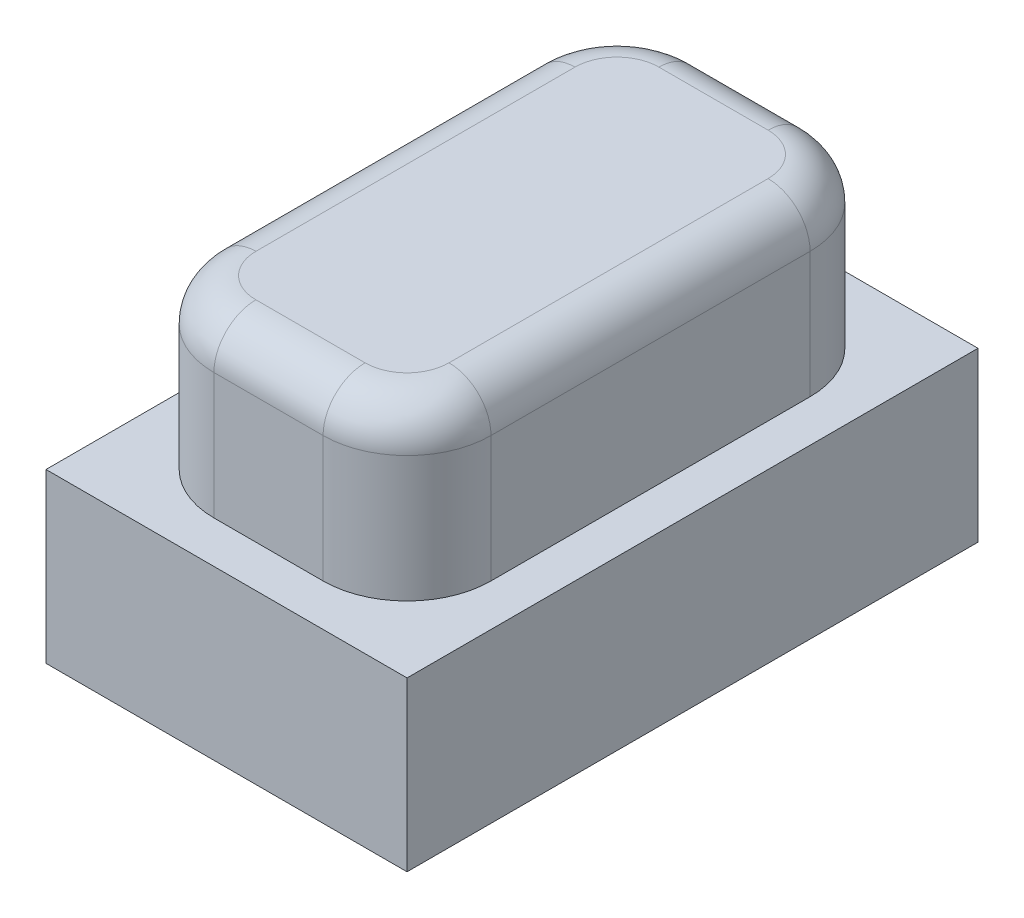
ISO-10303-21;
HEADER;
FILE_DESCRIPTION(('STEP AP214'),'2;1');
FILE_NAME('part.step','',(''),(''),'','','');
FILE_SCHEMA(('AUTOMOTIVE_DESIGN { 1 0 10303 214 1 1 1 1 }'));
ENDSEC;
DATA;
#1=APPLICATION_CONTEXT('core data for automotive mechanical design processes');
#2=APPLICATION_PROTOCOL_DEFINITION('international standard','automotive_design',2000,#1);
#3=PRODUCT_CONTEXT('',#1,'mechanical');
#4=PRODUCT('Part','Part','',(#3));
#5=PRODUCT_RELATED_PRODUCT_CATEGORY('part','',(#4));
#6=PRODUCT_DEFINITION_FORMATION('','',#4);
#7=PRODUCT_DEFINITION_CONTEXT('part definition',#1,'design');
#8=PRODUCT_DEFINITION('design','',#6,#7);
#9=PRODUCT_DEFINITION_SHAPE('','',#8);
#10=(LENGTH_UNIT() NAMED_UNIT(*) SI_UNIT(.MILLI.,.METRE.));
#11=(NAMED_UNIT(*) PLANE_ANGLE_UNIT() SI_UNIT($,.RADIAN.));
#12=(NAMED_UNIT(*) SI_UNIT($,.STERADIAN.) SOLID_ANGLE_UNIT());
#13=UNCERTAINTY_MEASURE_WITH_UNIT(LENGTH_MEASURE(1.E-05),#10,'distance_accuracy_value','');
#14=(GEOMETRIC_REPRESENTATION_CONTEXT(3) GLOBAL_UNCERTAINTY_ASSIGNED_CONTEXT((#13)) GLOBAL_UNIT_ASSIGNED_CONTEXT((#10,
#11,#12)) REPRESENTATION_CONTEXT('',''));
#15=CARTESIAN_POINT('',(0.,0.,0.));
#16=DIRECTION('',(0.,0.,1.));
#17=DIRECTION('',(1.,0.,0.));
#18=AXIS2_PLACEMENT_3D('',#15,#16,#17);
#19=CARTESIAN_POINT('',(0.65,2.,1.9));
#20=DIRECTION('',(0.,-1.,0.));
#21=DIRECTION('',(0.,0.,-1.));
#22=AXIS2_PLACEMENT_3D('',#19,#20,#21);
#23=CYLINDRICAL_SURFACE('',#22,1.);
#24=DIRECTION('',(0.,-1.,0.));
#25=VECTOR('',#24,1.);
#26=CARTESIAN_POINT('',(1.65,2.,1.89999999999999));
#27=LINE('',#26,#25);
#28=CARTESIAN_POINT('',(1.65,1.5,1.89999999999999));
#29=VERTEX_POINT('',#28);
#30=CARTESIAN_POINT('',(1.65,0.,1.89999999999999));
#31=VERTEX_POINT('',#30);
#32=EDGE_CURVE('E334',#29,#31,#27,.T.);
#33=ORIENTED_EDGE('',*,*,#32,.F.);
#34=CARTESIAN_POINT('',(0.65,1.5,1.9));
#35=DIRECTION('',(0.,1.,0.));
#36=DIRECTION('',(0.,0.,1.));
#37=AXIS2_PLACEMENT_3D('',#34,#35,#36);
#38=CIRCLE('',#37,1.);
#39=CARTESIAN_POINT('',(0.649999999999993,1.5,2.9));
#40=VERTEX_POINT('',#39);
#41=EDGE_CURVE('E53',#29,#40,#38,.F.);
#42=ORIENTED_EDGE('',*,*,#41,.T.);
#43=DIRECTION('',(0.,-1.,0.));
#44=VECTOR('',#43,1.);
#45=CARTESIAN_POINT('',(0.649999999999993,2.,2.9));
#46=LINE('',#45,#44);
#47=CARTESIAN_POINT('',(0.649999999999993,0.,2.9));
#48=VERTEX_POINT('',#47);
#49=EDGE_CURVE('E313',#40,#48,#46,.T.);
#50=ORIENTED_EDGE('',*,*,#49,.T.);
#51=CARTESIAN_POINT('',(0.65,0.,1.9));
#52=DIRECTION('',(0.,1.,0.));
#53=DIRECTION('',(0.,0.,1.));
#54=AXIS2_PLACEMENT_3D('',#51,#52,#53);
#55=CIRCLE('',#54,1.);
#56=EDGE_CURVE('E281',#48,#31,#55,.T.);
#57=ORIENTED_EDGE('',*,*,#56,.T.);
#58=EDGE_LOOP('',(#33,#42,#50,#57));
#59=FACE_BOUND('',#58,.T.);
#60=ADVANCED_FACE('F43',(#59),#23,.T.);
#61=CARTESIAN_POINT('',(1.65,2.,1.89999999999999));
#62=DIRECTION('',(-1.,0.,0.));
#63=DIRECTION('',(0.,0.,1.));
#64=AXIS2_PLACEMENT_3D('',#61,#62,#63);
#65=PLANE('',#64);
#66=DIRECTION('',(0.,-1.,0.));
#67=VECTOR('',#66,1.);
#68=CARTESIAN_POINT('',(1.65,2.,-1.89999999999999));
#69=LINE('',#68,#67);
#70=CARTESIAN_POINT('',(1.65,1.5,-1.89999999999999));
#71=VERTEX_POINT('',#70);
#72=CARTESIAN_POINT('',(1.65,0.,-1.89999999999999));
#73=VERTEX_POINT('',#72);
#74=EDGE_CURVE('E331',#71,#73,#69,.T.);
#75=ORIENTED_EDGE('',*,*,#74,.F.);
#76=DIRECTION('',(0.,0.,-1.));
#77=VECTOR('',#76,1.);
#78=CARTESIAN_POINT('',(1.65,1.5,1.89999999999999));
#79=LINE('',#78,#77);
#80=EDGE_CURVE('E68',#71,#29,#79,.F.);
#81=ORIENTED_EDGE('',*,*,#80,.T.);
#82=ORIENTED_EDGE('',*,*,#32,.T.);
#83=DIRECTION('',(0.,0.,-1.));
#84=VECTOR('',#83,1.);
#85=CARTESIAN_POINT('',(1.65,0.,1.89999999999999));
#86=LINE('',#85,#84);
#87=EDGE_CURVE('E285',#31,#73,#86,.T.);
#88=ORIENTED_EDGE('',*,*,#87,.T.);
#89=EDGE_LOOP('',(#75,#81,#82,#88));
#90=FACE_BOUND('',#89,.T.);
#91=ADVANCED_FACE('F424',(#90),#65,.F.);
#92=CARTESIAN_POINT('',(0.65,2.,-1.9));
#93=DIRECTION('',(0.,-1.,0.));
#94=DIRECTION('',(0.,0.,-1.));
#95=AXIS2_PLACEMENT_3D('',#92,#93,#94);
#96=CYLINDRICAL_SURFACE('',#95,1.);
#97=DIRECTION('',(0.,-1.,0.));
#98=VECTOR('',#97,1.);
#99=CARTESIAN_POINT('',(0.649999999999993,2.,-2.9));
#100=LINE('',#99,#98);
#101=CARTESIAN_POINT('',(0.649999999999993,1.5,-2.9));
#102=VERTEX_POINT('',#101);
#103=CARTESIAN_POINT('',(0.649999999999993,0.,-2.9));
#104=VERTEX_POINT('',#103);
#105=EDGE_CURVE('E328',#102,#104,#100,.T.);
#106=ORIENTED_EDGE('',*,*,#105,.F.);
#107=CARTESIAN_POINT('',(0.65,1.5,-1.9));
#108=DIRECTION('',(0.,1.,0.));
#109=DIRECTION('',(0.,0.,1.));
#110=AXIS2_PLACEMENT_3D('',#107,#108,#109);
#111=CIRCLE('',#110,1.);
#112=EDGE_CURVE('E375',#102,#71,#111,.F.);
#113=ORIENTED_EDGE('',*,*,#112,.T.);
#114=ORIENTED_EDGE('',*,*,#74,.T.);
#115=CARTESIAN_POINT('',(0.65,0.,-1.9));
#116=DIRECTION('',(0.,1.,0.));
#117=DIRECTION('',(0.,0.,-1.));
#118=AXIS2_PLACEMENT_3D('',#115,#116,#117);
#119=CIRCLE('',#118,1.);
#120=EDGE_CURVE('E289',#73,#104,#119,.T.);
#121=ORIENTED_EDGE('',*,*,#120,.T.);
#122=EDGE_LOOP('',(#106,#113,#114,#121));
#123=FACE_BOUND('',#122,.T.);
#124=ADVANCED_FACE('F422',(#123),#96,.T.);
#125=CARTESIAN_POINT('',(-0.649999999999993,2.,-2.9));
#126=DIRECTION('',(0.,0.,1.));
#127=DIRECTION('',(1.,0.,0.));
#128=AXIS2_PLACEMENT_3D('',#125,#126,#127);
#129=PLANE('',#128);
#130=DIRECTION('',(0.,-1.,0.));
#131=VECTOR('',#130,1.);
#132=CARTESIAN_POINT('',(-0.65,2.,-2.9));
#133=LINE('',#132,#131);
#134=CARTESIAN_POINT('',(-0.65,1.5,-2.9));
#135=VERTEX_POINT('',#134);
#136=CARTESIAN_POINT('',(-0.65,0.,-2.9));
#137=VERTEX_POINT('',#136);
#138=EDGE_CURVE('E325',#135,#137,#133,.T.);
#139=ORIENTED_EDGE('',*,*,#138,.F.);
#140=DIRECTION('',(-1.,0.,0.));
#141=VECTOR('',#140,1.);
#142=CARTESIAN_POINT('',(0.649999999999993,1.5,-2.9));
#143=LINE('',#142,#141);
#144=EDGE_CURVE('E372',#135,#102,#143,.F.);
#145=ORIENTED_EDGE('',*,*,#144,.T.);
#146=ORIENTED_EDGE('',*,*,#105,.T.);
#147=DIRECTION('',(-1.,0.,0.));
#148=VECTOR('',#147,1.);
#149=CARTESIAN_POINT('',(-0.649999999999993,0.,-2.9));
#150=LINE('',#149,#148);
#151=EDGE_CURVE('E293',#104,#137,#150,.T.);
#152=ORIENTED_EDGE('',*,*,#151,.T.);
#153=EDGE_LOOP('',(#139,#145,#146,#152));
#154=FACE_BOUND('',#153,.T.);
#155=ADVANCED_FACE('F464',(#154),#129,.F.);
#156=CARTESIAN_POINT('',(-0.65,2.,-1.9));
#157=DIRECTION('',(0.,-1.,0.));
#158=DIRECTION('',(0.,0.,-1.));
#159=AXIS2_PLACEMENT_3D('',#156,#157,#158);
#160=CYLINDRICAL_SURFACE('',#159,1.);
#161=DIRECTION('',(0.,-1.,0.));
#162=VECTOR('',#161,1.);
#163=CARTESIAN_POINT('',(-1.65,2.,-1.89999999999999));
#164=LINE('',#163,#162);
#165=CARTESIAN_POINT('',(-1.65,1.5,-1.89999999999999));
#166=VERTEX_POINT('',#165);
#167=CARTESIAN_POINT('',(-1.65,0.,-1.89999999999999));
#168=VERTEX_POINT('',#167);
#169=EDGE_CURVE('E322',#166,#168,#164,.T.);
#170=ORIENTED_EDGE('',*,*,#169,.F.);
#171=CARTESIAN_POINT('',(-0.65,1.5,-1.9));
#172=DIRECTION('',(0.,1.,0.));
#173=DIRECTION('',(0.,0.,1.));
#174=AXIS2_PLACEMENT_3D('',#171,#172,#173);
#175=CIRCLE('',#174,1.);
#176=EDGE_CURVE('E369',#166,#135,#175,.F.);
#177=ORIENTED_EDGE('',*,*,#176,.T.);
#178=ORIENTED_EDGE('',*,*,#138,.T.);
#179=CARTESIAN_POINT('',(-0.65,0.,-1.9));
#180=DIRECTION('',(0.,1.,0.));
#181=DIRECTION('',(0.,0.,-1.));
#182=AXIS2_PLACEMENT_3D('',#179,#180,#181);
#183=CIRCLE('',#182,1.);
#184=EDGE_CURVE('E297',#137,#168,#183,.T.);
#185=ORIENTED_EDGE('',*,*,#184,.T.);
#186=EDGE_LOOP('',(#170,#177,#178,#185));
#187=FACE_BOUND('',#186,.T.);
#188=ADVANCED_FACE('F460',(#187),#160,.T.);
#189=CARTESIAN_POINT('',(-1.65,2.,1.89999999999999));
#190=DIRECTION('',(1.,0.,0.));
#191=DIRECTION('',(0.,0.,-1.));
#192=AXIS2_PLACEMENT_3D('',#189,#190,#191);
#193=PLANE('',#192);
#194=DIRECTION('',(0.,-1.,0.));
#195=VECTOR('',#194,1.);
#196=CARTESIAN_POINT('',(-1.65,2.,1.89999999999999));
#197=LINE('',#196,#195);
#198=CARTESIAN_POINT('',(-1.65,1.5,1.89999999999999));
#199=VERTEX_POINT('',#198);
#200=CARTESIAN_POINT('',(-1.65,0.,1.89999999999999));
#201=VERTEX_POINT('',#200);
#202=EDGE_CURVE('E319',#199,#201,#197,.T.);
#203=ORIENTED_EDGE('',*,*,#202,.F.);
#204=DIRECTION('',(0.,0.,1.));
#205=VECTOR('',#204,1.);
#206=CARTESIAN_POINT('',(-1.65,1.5,-1.89999999999999));
#207=LINE('',#206,#205);
#208=EDGE_CURVE('E366',#199,#166,#207,.F.);
#209=ORIENTED_EDGE('',*,*,#208,.T.);
#210=ORIENTED_EDGE('',*,*,#169,.T.);
#211=DIRECTION('',(0.,0.,1.));
#212=VECTOR('',#211,1.);
#213=CARTESIAN_POINT('',(-1.65,0.,1.89999999999999));
#214=LINE('',#213,#212);
#215=EDGE_CURVE('E301',#168,#201,#214,.T.);
#216=ORIENTED_EDGE('',*,*,#215,.T.);
#217=EDGE_LOOP('',(#203,#209,#210,#216));
#218=FACE_BOUND('',#217,.T.);
#219=ADVANCED_FACE('F455',(#218),#193,.F.);
#220=CARTESIAN_POINT('',(-0.65,2.,1.9));
#221=DIRECTION('',(0.,-1.,0.));
#222=DIRECTION('',(0.,0.,-1.));
#223=AXIS2_PLACEMENT_3D('',#220,#221,#222);
#224=CYLINDRICAL_SURFACE('',#223,1.);
#225=DIRECTION('',(0.,-1.,0.));
#226=VECTOR('',#225,1.);
#227=CARTESIAN_POINT('',(-0.649999999999993,2.,2.9));
#228=LINE('',#227,#226);
#229=CARTESIAN_POINT('',(-0.649999999999993,1.5,2.9));
#230=VERTEX_POINT('',#229);
#231=CARTESIAN_POINT('',(-0.649999999999993,0.,2.9));
#232=VERTEX_POINT('',#231);
#233=EDGE_CURVE('E316',#230,#232,#228,.T.);
#234=ORIENTED_EDGE('',*,*,#233,.F.);
#235=CARTESIAN_POINT('',(-0.65,1.5,1.9));
#236=DIRECTION('',(0.,1.,0.));
#237=DIRECTION('',(0.,0.,1.));
#238=AXIS2_PLACEMENT_3D('',#235,#236,#237);
#239=CIRCLE('',#238,1.);
#240=EDGE_CURVE('E362',#230,#199,#239,.F.);
#241=ORIENTED_EDGE('',*,*,#240,.T.);
#242=ORIENTED_EDGE('',*,*,#202,.T.);
#243=CARTESIAN_POINT('',(-0.65,0.,1.9));
#244=DIRECTION('',(0.,1.,0.));
#245=DIRECTION('',(0.,0.,-1.));
#246=AXIS2_PLACEMENT_3D('',#243,#244,#245);
#247=CIRCLE('',#246,1.);
#248=EDGE_CURVE('E305',#201,#232,#247,.T.);
#249=ORIENTED_EDGE('',*,*,#248,.T.);
#250=EDGE_LOOP('',(#234,#241,#242,#249));
#251=FACE_BOUND('',#250,.T.);
#252=ADVANCED_FACE('F452',(#251),#224,.T.);
#253=CARTESIAN_POINT('',(-0.649999999999993,2.,2.9));
#254=DIRECTION('',(0.,0.,-1.));
#255=DIRECTION('',(-1.,0.,0.));
#256=AXIS2_PLACEMENT_3D('',#253,#254,#255);
#257=PLANE('',#256);
#258=ORIENTED_EDGE('',*,*,#49,.F.);
#259=DIRECTION('',(1.,0.,0.));
#260=VECTOR('',#259,1.);
#261=CARTESIAN_POINT('',(-0.649999999999993,1.5,2.9));
#262=LINE('',#261,#260);
#263=EDGE_CURVE('E11',#40,#230,#262,.F.);
#264=ORIENTED_EDGE('',*,*,#263,.T.);
#265=ORIENTED_EDGE('',*,*,#233,.T.);
#266=DIRECTION('',(1.,0.,0.));
#267=VECTOR('',#266,1.);
#268=CARTESIAN_POINT('',(-0.649999999999993,0.,2.9));
#269=LINE('',#268,#267);
#270=EDGE_CURVE('E309',#232,#48,#269,.T.);
#271=ORIENTED_EDGE('',*,*,#270,.T.);
#272=EDGE_LOOP('',(#258,#264,#265,#271));
#273=FACE_BOUND('',#272,.T.);
#274=ADVANCED_FACE('F434',(#273),#257,.F.);
#275=CARTESIAN_POINT('',(0.65,2.,1.9));
#276=DIRECTION('',(0.,1.,0.));
#277=DIRECTION('',(0.,0.,1.));
#278=AXIS2_PLACEMENT_3D('',#275,#276,#277);
#279=PLANE('',#278);
#280=DIRECTION('',(0.,0.,1.));
#281=VECTOR('',#280,1.);
#282=CARTESIAN_POINT('',(-1.15,2.,1.89999999999999));
#283=LINE('',#282,#281);
#284=CARTESIAN_POINT('',(-1.15,2.,-1.89999999999999));
#285=VERTEX_POINT('',#284);
#286=CARTESIAN_POINT('',(-1.15,2.,1.9));
#287=VERTEX_POINT('',#286);
#288=EDGE_CURVE('E355',#285,#287,#283,.T.);
#289=ORIENTED_EDGE('',*,*,#288,.T.);
#290=CARTESIAN_POINT('',(-0.65,2.,1.9));
#291=DIRECTION('',(0.,1.,0.));
#292=DIRECTION('',(0.,0.,1.));
#293=AXIS2_PLACEMENT_3D('',#290,#291,#292);
#294=CIRCLE('',#293,0.5);
#295=CARTESIAN_POINT('',(-0.649999999999996,2.,2.4));
#296=VERTEX_POINT('',#295);
#297=EDGE_CURVE('E358',#287,#296,#294,.T.);
#298=ORIENTED_EDGE('',*,*,#297,.T.);
#299=DIRECTION('',(1.,0.,0.));
#300=VECTOR('',#299,1.);
#301=CARTESIAN_POINT('',(0.649999999999993,2.,2.4));
#302=LINE('',#301,#300);
#303=CARTESIAN_POINT('',(0.649999999999997,2.,2.4));
#304=VERTEX_POINT('',#303);
#305=EDGE_CURVE('E337',#296,#304,#302,.T.);
#306=ORIENTED_EDGE('',*,*,#305,.T.);
#307=CARTESIAN_POINT('',(0.65,2.,1.9));
#308=DIRECTION('',(0.,1.,0.));
#309=DIRECTION('',(0.,0.,1.));
#310=AXIS2_PLACEMENT_3D('',#307,#308,#309);
#311=CIRCLE('',#310,0.5);
#312=CARTESIAN_POINT('',(1.15,2.,1.89999999999999));
#313=VERTEX_POINT('',#312);
#314=EDGE_CURVE('E340',#304,#313,#311,.T.);
#315=ORIENTED_EDGE('',*,*,#314,.T.);
#316=DIRECTION('',(0.,0.,-1.));
#317=VECTOR('',#316,1.);
#318=CARTESIAN_POINT('',(1.15,2.,-1.89999999999999));
#319=LINE('',#318,#317);
#320=CARTESIAN_POINT('',(1.15,2.,-1.9));
#321=VERTEX_POINT('',#320);
#322=EDGE_CURVE('E343',#313,#321,#319,.T.);
#323=ORIENTED_EDGE('',*,*,#322,.T.);
#324=CARTESIAN_POINT('',(0.65,2.,-1.9));
#325=DIRECTION('',(0.,1.,0.));
#326=DIRECTION('',(0.,0.,1.));
#327=AXIS2_PLACEMENT_3D('',#324,#325,#326);
#328=CIRCLE('',#327,0.5);
#329=CARTESIAN_POINT('',(0.649999999999993,2.,-2.4));
#330=VERTEX_POINT('',#329);
#331=EDGE_CURVE('E346',#321,#330,#328,.T.);
#332=ORIENTED_EDGE('',*,*,#331,.T.);
#333=DIRECTION('',(-1.,0.,0.));
#334=VECTOR('',#333,1.);
#335=CARTESIAN_POINT('',(-0.65,2.,-2.4));
#336=LINE('',#335,#334);
#337=CARTESIAN_POINT('',(-0.65,2.,-2.4));
#338=VERTEX_POINT('',#337);
#339=EDGE_CURVE('E349',#330,#338,#336,.T.);
#340=ORIENTED_EDGE('',*,*,#339,.T.);
#341=CARTESIAN_POINT('',(-0.65,2.,-1.9));
#342=DIRECTION('',(0.,1.,0.));
#343=DIRECTION('',(0.,0.,1.));
#344=AXIS2_PLACEMENT_3D('',#341,#342,#343);
#345=CIRCLE('',#344,0.5);
#346=EDGE_CURVE('E352',#338,#285,#345,.T.);
#347=ORIENTED_EDGE('',*,*,#346,.T.);
#348=EDGE_LOOP('',(#289,#298,#306,#315,#323,#332,#340,#347));
#349=FACE_BOUND('',#348,.T.);
#350=ADVANCED_FACE('F519',(#349),#279,.T.);
#351=CARTESIAN_POINT('',(0.,0.,0.));
#352=DIRECTION('',(0.,1.,0.));
#353=DIRECTION('',(0.,0.,1.));
#354=AXIS2_PLACEMENT_3D('',#351,#352,#353);
#355=PLANE('',#354);
#356=DIRECTION('',(0.,0.,-1.));
#357=VECTOR('',#356,1.);
#358=CARTESIAN_POINT('',(-2.15,0.,3.4));
#359=LINE('',#358,#357);
#360=CARTESIAN_POINT('',(-2.15,0.,3.4));
#361=VERTEX_POINT('',#360);
#362=CARTESIAN_POINT('',(-2.15,0.,-3.4));
#363=VERTEX_POINT('',#362);
#364=EDGE_CURVE('E252',#361,#363,#359,.T.);
#365=ORIENTED_EDGE('',*,*,#364,.F.);
#366=DIRECTION('',(-1.,0.,0.));
#367=VECTOR('',#366,1.);
#368=CARTESIAN_POINT('',(2.15,0.,3.4));
#369=LINE('',#368,#367);
#370=CARTESIAN_POINT('',(2.15,0.,3.4));
#371=VERTEX_POINT('',#370);
#372=EDGE_CURVE('E262',#371,#361,#369,.T.);
#373=ORIENTED_EDGE('',*,*,#372,.F.);
#374=DIRECTION('',(0.,0.,1.));
#375=VECTOR('',#374,1.);
#376=CARTESIAN_POINT('',(2.15,0.,3.4));
#377=LINE('',#376,#375);
#378=CARTESIAN_POINT('',(2.15,0.,-3.4));
#379=VERTEX_POINT('',#378);
#380=EDGE_CURVE('E259',#379,#371,#377,.T.);
#381=ORIENTED_EDGE('',*,*,#380,.F.);
#382=DIRECTION('',(1.,0.,0.));
#383=VECTOR('',#382,1.);
#384=CARTESIAN_POINT('',(2.15,0.,-3.4));
#385=LINE('',#384,#383);
#386=EDGE_CURVE('E256',#363,#379,#385,.T.);
#387=ORIENTED_EDGE('',*,*,#386,.F.);
#388=EDGE_LOOP('',(#365,#373,#381,#387));
#389=FACE_BOUND('',#388,.T.);
#390=ORIENTED_EDGE('',*,*,#56,.F.);
#391=ORIENTED_EDGE('',*,*,#270,.F.);
#392=ORIENTED_EDGE('',*,*,#248,.F.);
#393=ORIENTED_EDGE('',*,*,#215,.F.);
#394=ORIENTED_EDGE('',*,*,#184,.F.);
#395=ORIENTED_EDGE('',*,*,#151,.F.);
#396=ORIENTED_EDGE('',*,*,#120,.F.);
#397=ORIENTED_EDGE('',*,*,#87,.F.);
#398=EDGE_LOOP('',(#390,#391,#392,#393,#394,#395,#396,#397));
#399=FACE_BOUND('',#398,.T.);
#400=ADVANCED_FACE('F428',(#389,#399),#355,.T.);
#401=CARTESIAN_POINT('',(-2.15,-1.,3.4));
#402=DIRECTION('',(1.,0.,0.));
#403=DIRECTION('',(0.,0.,-1.));
#404=AXIS2_PLACEMENT_3D('',#401,#402,#403);
#405=PLANE('',#404);
#406=ORIENTED_EDGE('',*,*,#364,.T.);
#407=DIRECTION('',(0.,1.,0.));
#408=VECTOR('',#407,1.);
#409=CARTESIAN_POINT('',(-2.15,-1.,-3.4));
#410=LINE('',#409,#408);
#411=CARTESIAN_POINT('',(-2.15,-2.,-3.4));
#412=VERTEX_POINT('',#411);
#413=EDGE_CURVE('E277',#412,#363,#410,.T.);
#414=ORIENTED_EDGE('',*,*,#413,.F.);
#415=DIRECTION('',(0.,0.,-1.));
#416=VECTOR('',#415,1.);
#417=CARTESIAN_POINT('',(-2.15,-2.,-3.4));
#418=LINE('',#417,#416);
#419=CARTESIAN_POINT('',(-2.15,-2.,3.4));
#420=VERTEX_POINT('',#419);
#421=EDGE_CURVE('E244',#420,#412,#418,.T.);
#422=ORIENTED_EDGE('',*,*,#421,.F.);
#423=DIRECTION('',(0.,1.,0.));
#424=VECTOR('',#423,1.);
#425=CARTESIAN_POINT('',(-2.15,-1.,3.4));
#426=LINE('',#425,#424);
#427=EDGE_CURVE('E265',#420,#361,#426,.T.);
#428=ORIENTED_EDGE('',*,*,#427,.T.);
#429=EDGE_LOOP('',(#406,#414,#422,#428));
#430=FACE_BOUND('',#429,.T.);
#431=ADVANCED_FACE('F518',(#430),#405,.F.);
#432=CARTESIAN_POINT('',(2.15,-1.,-3.4));
#433=DIRECTION('',(0.,0.,1.));
#434=DIRECTION('',(1.,0.,0.));
#435=AXIS2_PLACEMENT_3D('',#432,#433,#434);
#436=PLANE('',#435);
#437=ORIENTED_EDGE('',*,*,#386,.T.);
#438=DIRECTION('',(0.,1.,0.));
#439=VECTOR('',#438,1.);
#440=CARTESIAN_POINT('',(2.15,-1.,-3.4));
#441=LINE('',#440,#439);
#442=CARTESIAN_POINT('',(2.15,-2.,-3.4));
#443=VERTEX_POINT('',#442);
#444=EDGE_CURVE('E273',#443,#379,#441,.T.);
#445=ORIENTED_EDGE('',*,*,#444,.F.);
#446=DIRECTION('',(1.,0.,0.));
#447=VECTOR('',#446,1.);
#448=CARTESIAN_POINT('',(2.15,-2.,-3.4));
#449=LINE('',#448,#447);
#450=EDGE_CURVE('E248',#412,#443,#449,.T.);
#451=ORIENTED_EDGE('',*,*,#450,.F.);
#452=ORIENTED_EDGE('',*,*,#413,.T.);
#453=EDGE_LOOP('',(#437,#445,#451,#452));
#454=FACE_BOUND('',#453,.T.);
#455=ADVANCED_FACE('F528',(#454),#436,.F.);
#456=CARTESIAN_POINT('',(2.15,-1.,3.4));
#457=DIRECTION('',(-1.,0.,0.));
#458=DIRECTION('',(0.,0.,1.));
#459=AXIS2_PLACEMENT_3D('',#456,#457,#458);
#460=PLANE('',#459);
#461=ORIENTED_EDGE('',*,*,#380,.T.);
#462=DIRECTION('',(0.,1.,0.));
#463=VECTOR('',#462,1.);
#464=CARTESIAN_POINT('',(2.15,-1.,3.4));
#465=LINE('',#464,#463);
#466=CARTESIAN_POINT('',(2.15,-2.,3.4));
#467=VERTEX_POINT('',#466);
#468=EDGE_CURVE('E269',#467,#371,#465,.T.);
#469=ORIENTED_EDGE('',*,*,#468,.F.);
#470=DIRECTION('',(0.,0.,1.));
#471=VECTOR('',#470,1.);
#472=CARTESIAN_POINT('',(2.15,-2.,-3.4));
#473=LINE('',#472,#471);
#474=EDGE_CURVE('E203',#443,#467,#473,.T.);
#475=ORIENTED_EDGE('',*,*,#474,.F.);
#476=ORIENTED_EDGE('',*,*,#444,.T.);
#477=EDGE_LOOP('',(#461,#469,#475,#476));
#478=FACE_BOUND('',#477,.T.);
#479=ADVANCED_FACE('F524',(#478),#460,.F.);
#480=CARTESIAN_POINT('',(2.15,-1.,3.4));
#481=DIRECTION('',(0.,0.,-1.));
#482=DIRECTION('',(-1.,0.,0.));
#483=AXIS2_PLACEMENT_3D('',#480,#481,#482);
#484=PLANE('',#483);
#485=ORIENTED_EDGE('',*,*,#372,.T.);
#486=ORIENTED_EDGE('',*,*,#427,.F.);
#487=DIRECTION('',(-1.,0.,0.));
#488=VECTOR('',#487,1.);
#489=CARTESIAN_POINT('',(2.15,-2.,3.4));
#490=LINE('',#489,#488);
#491=EDGE_CURVE('E240',#467,#420,#490,.T.);
#492=ORIENTED_EDGE('',*,*,#491,.F.);
#493=ORIENTED_EDGE('',*,*,#468,.T.);
#494=EDGE_LOOP('',(#485,#486,#492,#493));
#495=FACE_BOUND('',#494,.T.);
#496=ADVANCED_FACE('F521',(#495),#484,.F.);
#497=CARTESIAN_POINT('',(0.,-2.,0.));
#498=DIRECTION('',(0.,-1.,0.));
#499=DIRECTION('',(0.,0.,-1.));
#500=AXIS2_PLACEMENT_3D('',#497,#498,#499);
#501=PLANE('',#500);
#502=ORIENTED_EDGE('',*,*,#474,.T.);
#503=ORIENTED_EDGE('',*,*,#491,.T.);
#504=ORIENTED_EDGE('',*,*,#421,.T.);
#505=ORIENTED_EDGE('',*,*,#450,.T.);
#506=EDGE_LOOP('',(#502,#503,#504,#505));
#507=FACE_BOUND('',#506,.T.);
#508=DIRECTION('',(-1.,0.,0.));
#509=VECTOR('',#508,1.);
#510=CARTESIAN_POINT('',(1.65,-2.,2.9));
#511=LINE('',#510,#509);
#512=CARTESIAN_POINT('',(1.65,-2.,2.9));
#513=VERTEX_POINT('',#512);
#514=CARTESIAN_POINT('',(-1.65,-2.,2.9));
#515=VERTEX_POINT('',#514);
#516=EDGE_CURVE('E194',#513,#515,#511,.T.);
#517=ORIENTED_EDGE('',*,*,#516,.F.);
#518=DIRECTION('',(0.,0.,1.));
#519=VECTOR('',#518,1.);
#520=CARTESIAN_POINT('',(1.65,-2.,-2.9));
#521=LINE('',#520,#519);
#522=CARTESIAN_POINT('',(1.65,-2.,-2.9));
#523=VERTEX_POINT('',#522);
#524=EDGE_CURVE('E183',#523,#513,#521,.T.);
#525=ORIENTED_EDGE('',*,*,#524,.F.);
#526=DIRECTION('',(1.,0.,0.));
#527=VECTOR('',#526,1.);
#528=CARTESIAN_POINT('',(1.65,-2.,-2.9));
#529=LINE('',#528,#527);
#530=CARTESIAN_POINT('',(-1.65,-2.,-2.9));
#531=VERTEX_POINT('',#530);
#532=EDGE_CURVE('E213',#531,#523,#529,.T.);
#533=ORIENTED_EDGE('',*,*,#532,.F.);
#534=DIRECTION('',(0.,0.,-1.));
#535=VECTOR('',#534,1.);
#536=CARTESIAN_POINT('',(-1.65,-2.,-2.9));
#537=LINE('',#536,#535);
#538=EDGE_CURVE('E209',#515,#531,#537,.T.);
#539=ORIENTED_EDGE('',*,*,#538,.F.);
#540=EDGE_LOOP('',(#517,#525,#533,#539));
#541=FACE_BOUND('',#540,.T.);
#542=ADVANCED_FACE('F207',(#507,#541),#501,.T.);
#543=CARTESIAN_POINT('',(1.65,-2.,-2.9));
#544=DIRECTION('',(-1.,0.,0.));
#545=DIRECTION('',(0.,0.,1.));
#546=AXIS2_PLACEMENT_3D('',#543,#544,#545);
#547=PLANE('',#546);
#548=DIRECTION('',(0.,0.,1.));
#549=VECTOR('',#548,1.);
#550=CARTESIAN_POINT('',(1.65,-1.,-2.9));
#551=LINE('',#550,#549);
#552=CARTESIAN_POINT('',(1.65,-1.,-2.9));
#553=VERTEX_POINT('',#552);
#554=CARTESIAN_POINT('',(1.65,-1.,2.9));
#555=VERTEX_POINT('',#554);
#556=EDGE_CURVE('E218',#553,#555,#551,.T.);
#557=ORIENTED_EDGE('',*,*,#556,.F.);
#558=DIRECTION('',(0.,1.,0.));
#559=VECTOR('',#558,1.);
#560=CARTESIAN_POINT('',(1.65,-2.,-2.9));
#561=LINE('',#560,#559);
#562=EDGE_CURVE('E189',#523,#553,#561,.T.);
#563=ORIENTED_EDGE('',*,*,#562,.F.);
#564=ORIENTED_EDGE('',*,*,#524,.T.);
#565=DIRECTION('',(0.,1.,0.));
#566=VECTOR('',#565,1.);
#567=CARTESIAN_POINT('',(1.65,-2.,2.9));
#568=LINE('',#567,#566);
#569=EDGE_CURVE('E187',#513,#555,#568,.T.);
#570=ORIENTED_EDGE('',*,*,#569,.T.);
#571=EDGE_LOOP('',(#557,#563,#564,#570));
#572=FACE_BOUND('',#571,.T.);
#573=ADVANCED_FACE('F186',(#572),#547,.T.);
#574=CARTESIAN_POINT('',(1.65,-2.,2.9));
#575=DIRECTION('',(0.,0.,-1.));
#576=DIRECTION('',(-1.,0.,0.));
#577=AXIS2_PLACEMENT_3D('',#574,#575,#576);
#578=PLANE('',#577);
#579=DIRECTION('',(-1.,0.,0.));
#580=VECTOR('',#579,1.);
#581=CARTESIAN_POINT('',(1.65,-1.,2.9));
#582=LINE('',#581,#580);
#583=CARTESIAN_POINT('',(-1.65,-1.,2.9));
#584=VERTEX_POINT('',#583);
#585=EDGE_CURVE('E201',#555,#584,#582,.T.);
#586=ORIENTED_EDGE('',*,*,#585,.F.);
#587=ORIENTED_EDGE('',*,*,#569,.F.);
#588=ORIENTED_EDGE('',*,*,#516,.T.);
#589=DIRECTION('',(0.,1.,0.));
#590=VECTOR('',#589,1.);
#591=CARTESIAN_POINT('',(-1.65,-2.,2.9));
#592=LINE('',#591,#590);
#593=EDGE_CURVE('E204',#515,#584,#592,.T.);
#594=ORIENTED_EDGE('',*,*,#593,.T.);
#595=EDGE_LOOP('',(#586,#587,#588,#594));
#596=FACE_BOUND('',#595,.T.);
#597=ADVANCED_FACE('F198',(#596),#578,.T.);
#598=CARTESIAN_POINT('',(-1.65,-2.,-2.9));
#599=DIRECTION('',(1.,0.,0.));
#600=DIRECTION('',(0.,0.,-1.));
#601=AXIS2_PLACEMENT_3D('',#598,#599,#600);
#602=PLANE('',#601);
#603=DIRECTION('',(0.,0.,-1.));
#604=VECTOR('',#603,1.);
#605=CARTESIAN_POINT('',(-1.65,-1.,-2.9));
#606=LINE('',#605,#604);
#607=CARTESIAN_POINT('',(-1.65,-1.,-2.9));
#608=VERTEX_POINT('',#607);
#609=EDGE_CURVE('E223',#584,#608,#606,.T.);
#610=ORIENTED_EDGE('',*,*,#609,.F.);
#611=ORIENTED_EDGE('',*,*,#593,.F.);
#612=ORIENTED_EDGE('',*,*,#538,.T.);
#613=DIRECTION('',(0.,1.,0.));
#614=VECTOR('',#613,1.);
#615=CARTESIAN_POINT('',(-1.65,-2.,-2.9));
#616=LINE('',#615,#614);
#617=EDGE_CURVE('E232',#531,#608,#616,.T.);
#618=ORIENTED_EDGE('',*,*,#617,.T.);
#619=EDGE_LOOP('',(#610,#611,#612,#618));
#620=FACE_BOUND('',#619,.T.);
#621=ADVANCED_FACE('F510',(#620),#602,.T.);
#622=CARTESIAN_POINT('',(1.65,-2.,-2.9));
#623=DIRECTION('',(0.,0.,1.));
#624=DIRECTION('',(1.,0.,0.));
#625=AXIS2_PLACEMENT_3D('',#622,#623,#624);
#626=PLANE('',#625);
#627=DIRECTION('',(1.,0.,0.));
#628=VECTOR('',#627,1.);
#629=CARTESIAN_POINT('',(1.65,-1.,-2.9));
#630=LINE('',#629,#628);
#631=EDGE_CURVE('E195',#608,#553,#630,.T.);
#632=ORIENTED_EDGE('',*,*,#631,.F.);
#633=ORIENTED_EDGE('',*,*,#617,.F.);
#634=ORIENTED_EDGE('',*,*,#532,.T.);
#635=ORIENTED_EDGE('',*,*,#562,.T.);
#636=EDGE_LOOP('',(#632,#633,#634,#635));
#637=FACE_BOUND('',#636,.T.);
#638=ADVANCED_FACE('F504',(#637),#626,.T.);
#639=CARTESIAN_POINT('',(0.,-1.,0.));
#640=DIRECTION('',(0.,1.,0.));
#641=DIRECTION('',(0.,0.,1.));
#642=AXIS2_PLACEMENT_3D('',#639,#640,#641);
#643=PLANE('',#642);
#644=ORIENTED_EDGE('',*,*,#631,.T.);
#645=ORIENTED_EDGE('',*,*,#556,.T.);
#646=ORIENTED_EDGE('',*,*,#585,.T.);
#647=ORIENTED_EDGE('',*,*,#609,.T.);
#648=EDGE_LOOP('',(#644,#645,#646,#647));
#649=FACE_BOUND('',#648,.T.);
#650=ADVANCED_FACE('F500',(#649),#643,.F.);
#651=CARTESIAN_POINT('',(0.65,1.5,-1.9));
#652=DIRECTION('',(0.,1.,0.));
#653=DIRECTION('',(0.,0.,1.));
#654=AXIS2_PLACEMENT_3D('',#651,#652,#653);
#655=DEGENERATE_TOROIDAL_SURFACE('',#654,0.5,0.5,.T.);
#656=CARTESIAN_POINT('',(1.15,1.5,-1.9));
#657=DIRECTION('',(0.,0.,1.));
#658=DIRECTION('',(1.,0.,0.));
#659=AXIS2_PLACEMENT_3D('',#656,#657,#658);
#660=CIRCLE('',#659,0.5);
#661=EDGE_CURVE('E403',#71,#321,#660,.T.);
#662=ORIENTED_EDGE('',*,*,#661,.F.);
#663=ORIENTED_EDGE('',*,*,#112,.F.);
#664=CARTESIAN_POINT('',(0.649999999999993,1.5,-2.4));
#665=DIRECTION('',(-1.,0.,0.));
#666=DIRECTION('',(0.,0.,1.));
#667=AXIS2_PLACEMENT_3D('',#664,#665,#666);
#668=CIRCLE('',#667,0.5);
#669=EDGE_CURVE('E47',#330,#102,#668,.T.);
#670=ORIENTED_EDGE('',*,*,#669,.F.);
#671=ORIENTED_EDGE('',*,*,#331,.F.);
#672=EDGE_LOOP('',(#662,#663,#670,#671));
#673=FACE_BOUND('',#672,.T.);
#674=ADVANCED_FACE('F45',(#673),#655,.T.);
#675=CARTESIAN_POINT('',(0.65,1.5,-2.4));
#676=DIRECTION('',(1.,0.,0.));
#677=DIRECTION('',(0.,0.,-1.));
#678=AXIS2_PLACEMENT_3D('',#675,#676,#677);
#679=CYLINDRICAL_SURFACE('',#678,0.5);
#680=ORIENTED_EDGE('',*,*,#669,.T.);
#681=ORIENTED_EDGE('',*,*,#144,.F.);
#682=CARTESIAN_POINT('',(-0.65,1.5,-2.4));
#683=DIRECTION('',(-1.,0.,0.));
#684=DIRECTION('',(0.,0.,1.));
#685=AXIS2_PLACEMENT_3D('',#682,#683,#684);
#686=CIRCLE('',#685,0.5);
#687=EDGE_CURVE('E400',#338,#135,#686,.T.);
#688=ORIENTED_EDGE('',*,*,#687,.F.);
#689=ORIENTED_EDGE('',*,*,#339,.F.);
#690=EDGE_LOOP('',(#680,#681,#688,#689));
#691=FACE_BOUND('',#690,.T.);
#692=ADVANCED_FACE('F415',(#691),#679,.T.);
#693=CARTESIAN_POINT('',(1.15,1.5,1.9));
#694=DIRECTION('',(0.,0.,1.));
#695=DIRECTION('',(1.,0.,0.));
#696=AXIS2_PLACEMENT_3D('',#693,#694,#695);
#697=CYLINDRICAL_SURFACE('',#696,0.5);
#698=ORIENTED_EDGE('',*,*,#661,.T.);
#699=ORIENTED_EDGE('',*,*,#322,.F.);
#700=CARTESIAN_POINT('',(1.15,1.5,1.89999999999999));
#701=DIRECTION('',(0.,0.,1.));
#702=DIRECTION('',(1.,0.,0.));
#703=AXIS2_PLACEMENT_3D('',#700,#701,#702);
#704=CIRCLE('',#703,0.5);
#705=EDGE_CURVE('E396',#29,#313,#704,.T.);
#706=ORIENTED_EDGE('',*,*,#705,.F.);
#707=ORIENTED_EDGE('',*,*,#80,.F.);
#708=EDGE_LOOP('',(#698,#699,#706,#707));
#709=FACE_BOUND('',#708,.T.);
#710=ADVANCED_FACE('F493',(#709),#697,.T.);
#711=CARTESIAN_POINT('',(-0.65,1.5,-1.9));
#712=DIRECTION('',(0.,1.,0.));
#713=DIRECTION('',(0.,0.,1.));
#714=AXIS2_PLACEMENT_3D('',#711,#712,#713);
#715=DEGENERATE_TOROIDAL_SURFACE('',#714,0.5,0.5,.T.);
#716=ORIENTED_EDGE('',*,*,#687,.T.);
#717=ORIENTED_EDGE('',*,*,#176,.F.);
#718=CARTESIAN_POINT('',(-1.15,1.5,-1.89999999999999));
#719=DIRECTION('',(0.,0.,1.));
#720=DIRECTION('',(1.,0.,0.));
#721=AXIS2_PLACEMENT_3D('',#718,#719,#720);
#722=CIRCLE('',#721,0.5);
#723=EDGE_CURVE('E392',#285,#166,#722,.T.);
#724=ORIENTED_EDGE('',*,*,#723,.F.);
#725=ORIENTED_EDGE('',*,*,#346,.F.);
#726=EDGE_LOOP('',(#716,#717,#724,#725));
#727=FACE_BOUND('',#726,.T.);
#728=ADVANCED_FACE('F490',(#727),#715,.T.);
#729=CARTESIAN_POINT('',(0.65,1.5,1.9));
#730=DIRECTION('',(0.,1.,0.));
#731=DIRECTION('',(0.,0.,1.));
#732=AXIS2_PLACEMENT_3D('',#729,#730,#731);
#733=DEGENERATE_TOROIDAL_SURFACE('',#732,0.5,0.5,.T.);
#734=ORIENTED_EDGE('',*,*,#705,.T.);
#735=ORIENTED_EDGE('',*,*,#314,.F.);
#736=CARTESIAN_POINT('',(0.649999999999997,1.5,2.4));
#737=DIRECTION('',(-1.,0.,0.));
#738=DIRECTION('',(0.,0.,1.));
#739=AXIS2_PLACEMENT_3D('',#736,#737,#738);
#740=CIRCLE('',#739,0.5);
#741=EDGE_CURVE('E388',#40,#304,#740,.T.);
#742=ORIENTED_EDGE('',*,*,#741,.F.);
#743=ORIENTED_EDGE('',*,*,#41,.F.);
#744=EDGE_LOOP('',(#734,#735,#742,#743));
#745=FACE_BOUND('',#744,.T.);
#746=ADVANCED_FACE('F439',(#745),#733,.T.);
#747=CARTESIAN_POINT('',(-1.15,1.5,1.9));
#748=DIRECTION('',(0.,0.,-1.));
#749=DIRECTION('',(-1.,0.,0.));
#750=AXIS2_PLACEMENT_3D('',#747,#748,#749);
#751=CYLINDRICAL_SURFACE('',#750,0.5);
#752=ORIENTED_EDGE('',*,*,#723,.T.);
#753=ORIENTED_EDGE('',*,*,#208,.F.);
#754=CARTESIAN_POINT('',(-1.15,1.5,1.9));
#755=DIRECTION('',(0.,0.,1.));
#756=DIRECTION('',(1.,0.,0.));
#757=AXIS2_PLACEMENT_3D('',#754,#755,#756);
#758=CIRCLE('',#757,0.5);
#759=EDGE_CURVE('E385',#287,#199,#758,.T.);
#760=ORIENTED_EDGE('',*,*,#759,.F.);
#761=ORIENTED_EDGE('',*,*,#288,.F.);
#762=EDGE_LOOP('',(#752,#753,#760,#761));
#763=FACE_BOUND('',#762,.T.);
#764=ADVANCED_FACE('F484',(#763),#751,.T.);
#765=CARTESIAN_POINT('',(0.65,1.5,2.4));
#766=DIRECTION('',(-1.,0.,0.));
#767=DIRECTION('',(0.,0.,1.));
#768=AXIS2_PLACEMENT_3D('',#765,#766,#767);
#769=CYLINDRICAL_SURFACE('',#768,0.5);
#770=ORIENTED_EDGE('',*,*,#741,.T.);
#771=ORIENTED_EDGE('',*,*,#305,.F.);
#772=CARTESIAN_POINT('',(-0.649999999999993,1.5,2.4));
#773=DIRECTION('',(-1.,0.,0.));
#774=DIRECTION('',(0.,-1.,0.));
#775=AXIS2_PLACEMENT_3D('',#772,#773,#774);
#776=CIRCLE('',#775,0.5);
#777=EDGE_CURVE('E382',#230,#296,#776,.T.);
#778=ORIENTED_EDGE('',*,*,#777,.F.);
#779=ORIENTED_EDGE('',*,*,#263,.F.);
#780=EDGE_LOOP('',(#770,#771,#778,#779));
#781=FACE_BOUND('',#780,.T.);
#782=ADVANCED_FACE('F443',(#781),#769,.T.);
#783=CARTESIAN_POINT('',(-0.65,1.5,1.9));
#784=DIRECTION('',(0.,1.,0.));
#785=DIRECTION('',(0.,0.,1.));
#786=AXIS2_PLACEMENT_3D('',#783,#784,#785);
#787=DEGENERATE_TOROIDAL_SURFACE('',#786,0.5,0.5,.T.);
#788=ORIENTED_EDGE('',*,*,#759,.T.);
#789=ORIENTED_EDGE('',*,*,#240,.F.);
#790=ORIENTED_EDGE('',*,*,#777,.T.);
#791=ORIENTED_EDGE('',*,*,#297,.F.);
#792=EDGE_LOOP('',(#788,#789,#790,#791));
#793=FACE_BOUND('',#792,.T.);
#794=ADVANCED_FACE('F447',(#793),#787,.T.);
#795=CLOSED_SHELL('',(#60,#91,#124,#155,#188,#219,#252,#274,#350,#400,#431,#455,#479,#496,#542,
#573,#597,#621,#638,#650,#674,#692,#710,#728,#746,#764,#782,#794));
#796=MANIFOLD_SOLID_BREP('B2',#795);
#797=ADVANCED_BREP_SHAPE_REPRESENTATION('',(#18,#796),#14);
#798=SHAPE_DEFINITION_REPRESENTATION(#9,#797);
ENDSEC;
END-ISO-10303-21;
